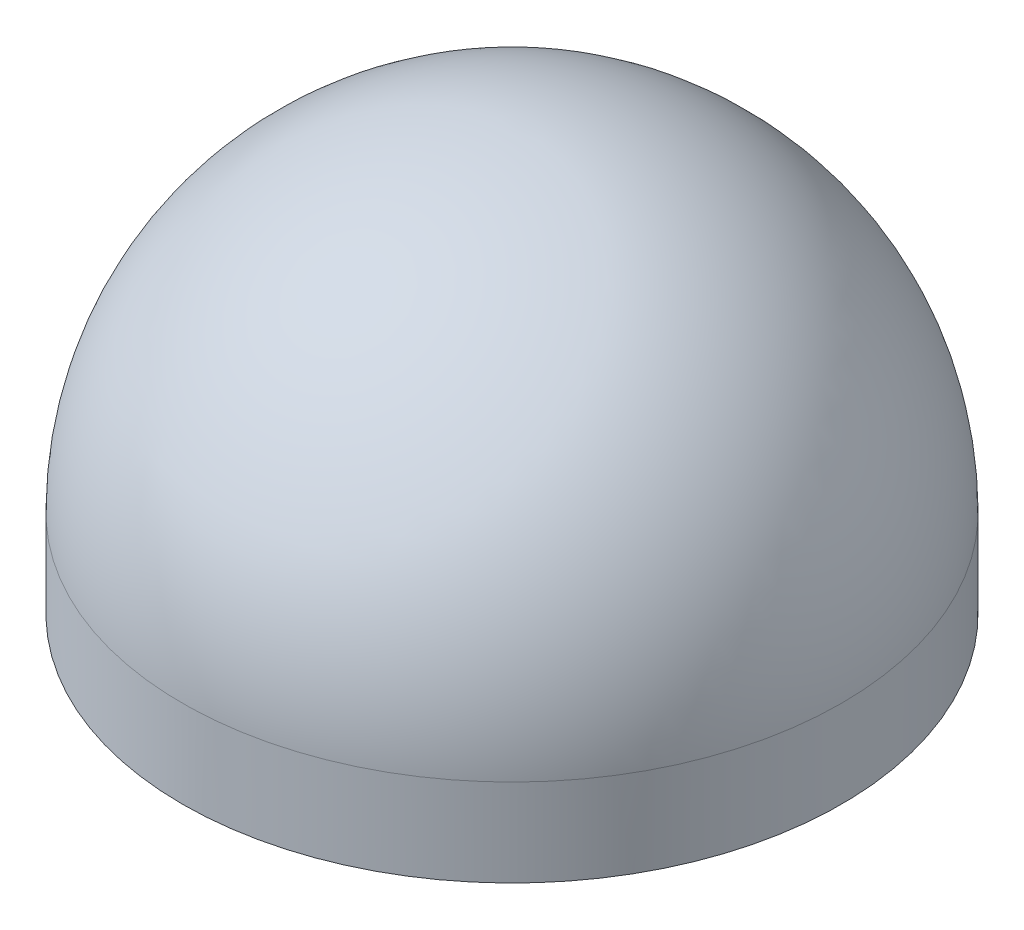
ISO-10303-21;
HEADER;
FILE_DESCRIPTION(('STEP AP214'),'2;1');
FILE_NAME('part.step','',(''),(''),'','','');
FILE_SCHEMA(('AUTOMOTIVE_DESIGN { 1 0 10303 214 1 1 1 1 }'));
ENDSEC;
DATA;
#1=APPLICATION_CONTEXT('core data for automotive mechanical design processes');
#2=APPLICATION_PROTOCOL_DEFINITION('international standard','automotive_design',2000,#1);
#3=PRODUCT_CONTEXT('',#1,'mechanical');
#4=PRODUCT('Part','Part','',(#3));
#5=PRODUCT_RELATED_PRODUCT_CATEGORY('part','',(#4));
#6=PRODUCT_DEFINITION_FORMATION('','',#4);
#7=PRODUCT_DEFINITION_CONTEXT('part definition',#1,'design');
#8=PRODUCT_DEFINITION('design','',#6,#7);
#9=PRODUCT_DEFINITION_SHAPE('','',#8);
#10=(LENGTH_UNIT() NAMED_UNIT(*) SI_UNIT(.MILLI.,.METRE.));
#11=(NAMED_UNIT(*) PLANE_ANGLE_UNIT() SI_UNIT($,.RADIAN.));
#12=(NAMED_UNIT(*) SI_UNIT($,.STERADIAN.) SOLID_ANGLE_UNIT());
#13=UNCERTAINTY_MEASURE_WITH_UNIT(LENGTH_MEASURE(1.E-05),#10,'distance_accuracy_value','');
#14=(GEOMETRIC_REPRESENTATION_CONTEXT(3) GLOBAL_UNCERTAINTY_ASSIGNED_CONTEXT((#13)) GLOBAL_UNIT_ASSIGNED_CONTEXT((#10,
#11,#12)) REPRESENTATION_CONTEXT('',''));
#15=CARTESIAN_POINT('',(0.,0.,0.));
#16=DIRECTION('',(0.,0.,1.));
#17=DIRECTION('',(1.,0.,0.));
#18=AXIS2_PLACEMENT_3D('',#15,#16,#17);
#19=CARTESIAN_POINT('',(0.,0.,0.));
#20=DIRECTION('',(0.,-1.,0.));
#21=DIRECTION('',(0.,0.,-1.));
#22=AXIS2_PLACEMENT_3D('',#19,#20,#21);
#23=CYLINDRICAL_SURFACE('',#22,22.225);
#24=CARTESIAN_POINT('',(0.,0.,0.));
#25=DIRECTION('',(0.,-1.,0.));
#26=DIRECTION('',(0.,0.,-1.));
#27=AXIS2_PLACEMENT_3D('',#24,#25,#26);
#28=CIRCLE('',#27,22.225);
#29=CARTESIAN_POINT('',(0.,0.,-22.225));
#30=VERTEX_POINT('',#29);
#31=EDGE_CURVE('E62',#30,#30,#28,.T.);
#32=ORIENTED_EDGE('',*,*,#31,.F.);
#33=EDGE_LOOP('',(#32));
#34=FACE_BOUND('',#33,.T.);
#35=CARTESIAN_POINT('',(0.,5.896631452317,0.));
#36=DIRECTION('',(0.,-1.,0.));
#37=DIRECTION('',(0.,0.,-1.));
#38=AXIS2_PLACEMENT_3D('',#35,#36,#37);
#39=CIRCLE('',#38,22.225);
#40=CARTESIAN_POINT('',(0.,5.896631452317,-22.225));
#41=VERTEX_POINT('',#40);
#42=EDGE_CURVE('E10',#41,#41,#39,.T.);
#43=ORIENTED_EDGE('',*,*,#42,.T.);
#44=EDGE_LOOP('',(#43));
#45=FACE_BOUND('',#44,.T.);
#46=ADVANCED_FACE('F31',(#34,#45),#23,.T.);
#47=CARTESIAN_POINT('',(0.,5.896631452317,0.));
#48=DIRECTION('',(0.,-1.,0.));
#49=DIRECTION('',(1.,0.,0.));
#50=AXIS2_PLACEMENT_3D('',#47,#48,#49);
#51=SPHERICAL_SURFACE('',#50,22.225);
#52=ORIENTED_EDGE('',*,*,#42,.F.);
#53=EDGE_LOOP('',(#52));
#54=FACE_BOUND('',#53,.T.);
#55=ADVANCED_FACE('F69',(#54),#51,.T.);
#56=CARTESIAN_POINT('',(6.35,24.946631452317,0.));
#57=DIRECTION('',(0.,1.,0.));
#58=DIRECTION('',(0.,0.,1.));
#59=AXIS2_PLACEMENT_3D('',#56,#57,#58);
#60=PLANE('',#59);
#61=CARTESIAN_POINT('',(0.,24.946631452317,0.));
#62=DIRECTION('',(0.,-1.,0.));
#63=DIRECTION('',(0.,0.,-1.));
#64=AXIS2_PLACEMENT_3D('',#61,#62,#63);
#65=CIRCLE('',#64,6.35);
#66=CARTESIAN_POINT('',(0.,24.946631452317,-6.35));
#67=VERTEX_POINT('',#66);
#68=EDGE_CURVE('E37',#67,#67,#65,.T.);
#69=ORIENTED_EDGE('',*,*,#68,.T.);
#70=EDGE_LOOP('',(#69));
#71=FACE_BOUND('',#70,.T.);
#72=ADVANCED_FACE('F73',(#71),#60,.F.);
#73=CARTESIAN_POINT('',(0.,3.76205517950723,0.));
#74=DIRECTION('',(0.,-1.,0.));
#75=DIRECTION('',(0.,0.,-1.));
#76=AXIS2_PLACEMENT_3D('',#73,#74,#75);
#77=CONICAL_SURFACE('',#76,21.1836,0.610865238198017);
#78=ORIENTED_EDGE('',*,*,#68,.F.);
#79=EDGE_LOOP('',(#78));
#80=FACE_BOUND('',#79,.T.);
#81=CARTESIAN_POINT('',(0.,3.76205517950723,0.));
#82=DIRECTION('',(0.,-1.,0.));
#83=DIRECTION('',(0.,0.,-1.));
#84=AXIS2_PLACEMENT_3D('',#81,#82,#83);
#85=CIRCLE('',#84,21.1836);
#86=CARTESIAN_POINT('',(0.,3.76205517950723,-21.1836));
#87=VERTEX_POINT('',#86);
#88=EDGE_CURVE('E41',#87,#87,#85,.T.);
#89=ORIENTED_EDGE('',*,*,#88,.T.);
#90=EDGE_LOOP('',(#89));
#91=FACE_BOUND('',#90,.T.);
#92=ADVANCED_FACE('F78',(#80,#91),#77,.F.);
#93=CARTESIAN_POINT('',(0.,0.,0.));
#94=DIRECTION('',(0.,-1.,0.));
#95=DIRECTION('',(0.,0.,-1.));
#96=AXIS2_PLACEMENT_3D('',#93,#94,#95);
#97=CYLINDRICAL_SURFACE('',#96,21.1836);
#98=ORIENTED_EDGE('',*,*,#88,.F.);
#99=EDGE_LOOP('',(#98));
#100=FACE_BOUND('',#99,.T.);
#101=CARTESIAN_POINT('',(0.,2.1082,0.));
#102=DIRECTION('',(0.,-1.,0.));
#103=DIRECTION('',(0.,0.,-1.));
#104=AXIS2_PLACEMENT_3D('',#101,#102,#103);
#105=CIRCLE('',#104,21.1836);
#106=CARTESIAN_POINT('',(0.,2.1082,-21.1836));
#107=VERTEX_POINT('',#106);
#108=EDGE_CURVE('E45',#107,#107,#105,.T.);
#109=ORIENTED_EDGE('',*,*,#108,.T.);
#110=EDGE_LOOP('',(#109));
#111=FACE_BOUND('',#110,.T.);
#112=ADVANCED_FACE('F83',(#100,#111),#97,.F.);
#113=CARTESIAN_POINT('',(6.35,2.1082,0.));
#114=DIRECTION('',(0.,-1.,0.));
#115=DIRECTION('',(0.,0.,-1.));
#116=AXIS2_PLACEMENT_3D('',#113,#114,#115);
#117=PLANE('',#116);
#118=ORIENTED_EDGE('',*,*,#108,.F.);
#119=EDGE_LOOP('',(#118));
#120=FACE_BOUND('',#119,.T.);
#121=CARTESIAN_POINT('',(0.,2.1082,0.));
#122=DIRECTION('',(0.,-1.,0.));
#123=DIRECTION('',(0.,0.,-1.));
#124=AXIS2_PLACEMENT_3D('',#121,#122,#123);
#125=CIRCLE('',#124,6.35);
#126=CARTESIAN_POINT('',(0.,2.1082,-6.35));
#127=VERTEX_POINT('',#126);
#128=EDGE_CURVE('E50',#127,#127,#125,.T.);
#129=ORIENTED_EDGE('',*,*,#128,.T.);
#130=EDGE_LOOP('',(#129));
#131=FACE_BOUND('',#130,.T.);
#132=ADVANCED_FACE('F87',(#120,#131),#117,.F.);
#133=CARTESIAN_POINT('',(0.,0.,0.));
#134=DIRECTION('',(0.,-1.,0.));
#135=DIRECTION('',(0.,0.,-1.));
#136=AXIS2_PLACEMENT_3D('',#133,#134,#135);
#137=CYLINDRICAL_SURFACE('',#136,6.35);
#138=ORIENTED_EDGE('',*,*,#128,.F.);
#139=EDGE_LOOP('',(#138));
#140=FACE_BOUND('',#139,.T.);
#141=CARTESIAN_POINT('',(0.,6.35,0.));
#142=DIRECTION('',(0.,-1.,0.));
#143=DIRECTION('',(0.,0.,-1.));
#144=AXIS2_PLACEMENT_3D('',#141,#142,#143);
#145=CIRCLE('',#144,6.35);
#146=CARTESIAN_POINT('',(0.,6.35,-6.35));
#147=VERTEX_POINT('',#146);
#148=EDGE_CURVE('E53',#147,#147,#145,.T.);
#149=ORIENTED_EDGE('',*,*,#148,.T.);
#150=EDGE_LOOP('',(#149));
#151=FACE_BOUND('',#150,.T.);
#152=ADVANCED_FACE('F91',(#140,#151),#137,.T.);
#153=CARTESIAN_POINT('',(1.5875,6.35,0.));
#154=DIRECTION('',(0.,-1.,0.));
#155=DIRECTION('',(0.,0.,-1.));
#156=AXIS2_PLACEMENT_3D('',#153,#154,#155);
#157=PLANE('',#156);
#158=ORIENTED_EDGE('',*,*,#148,.F.);
#159=EDGE_LOOP('',(#158));
#160=FACE_BOUND('',#159,.T.);
#161=CARTESIAN_POINT('',(0.,6.35,0.));
#162=DIRECTION('',(0.,-1.,0.));
#163=DIRECTION('',(0.,0.,-1.));
#164=AXIS2_PLACEMENT_3D('',#161,#162,#163);
#165=CIRCLE('',#164,1.5875);
#166=CARTESIAN_POINT('',(0.,6.35,-1.5875));
#167=VERTEX_POINT('',#166);
#168=EDGE_CURVE('E56',#167,#167,#165,.T.);
#169=ORIENTED_EDGE('',*,*,#168,.T.);
#170=EDGE_LOOP('',(#169));
#171=FACE_BOUND('',#170,.T.);
#172=ADVANCED_FACE('F95',(#160,#171),#157,.F.);
#173=CARTESIAN_POINT('',(0.,0.,0.));
#174=DIRECTION('',(0.,-1.,0.));
#175=DIRECTION('',(0.,0.,-1.));
#176=AXIS2_PLACEMENT_3D('',#173,#174,#175);
#177=CYLINDRICAL_SURFACE('',#176,1.5875);
#178=ORIENTED_EDGE('',*,*,#168,.F.);
#179=EDGE_LOOP('',(#178));
#180=FACE_BOUND('',#179,.T.);
#181=CARTESIAN_POINT('',(0.,0.,0.));
#182=DIRECTION('',(0.,-1.,0.));
#183=DIRECTION('',(0.,0.,-1.));
#184=AXIS2_PLACEMENT_3D('',#181,#182,#183);
#185=CIRCLE('',#184,1.5875);
#186=CARTESIAN_POINT('',(0.,0.,-1.5875));
#187=VERTEX_POINT('',#186);
#188=EDGE_CURVE('E59',#187,#187,#185,.T.);
#189=ORIENTED_EDGE('',*,*,#188,.T.);
#190=EDGE_LOOP('',(#189));
#191=FACE_BOUND('',#190,.T.);
#192=ADVANCED_FACE('F99',(#180,#191),#177,.F.);
#193=CARTESIAN_POINT('',(1.5875,0.,0.));
#194=DIRECTION('',(0.,1.,0.));
#195=DIRECTION('',(0.,0.,1.));
#196=AXIS2_PLACEMENT_3D('',#193,#194,#195);
#197=PLANE('',#196);
#198=ORIENTED_EDGE('',*,*,#188,.F.);
#199=EDGE_LOOP('',(#198));
#200=FACE_BOUND('',#199,.T.);
#201=ORIENTED_EDGE('',*,*,#31,.T.);
#202=EDGE_LOOP('',(#201));
#203=FACE_BOUND('',#202,.T.);
#204=ADVANCED_FACE('F66',(#200,#203),#197,.F.);
#205=CLOSED_SHELL('',(#46,#55,#72,#92,#112,#132,#152,#172,#192,#204));
#206=MANIFOLD_SOLID_BREP('B2',#205);
#207=ADVANCED_BREP_SHAPE_REPRESENTATION('',(#18,#206),#14);
#208=SHAPE_DEFINITION_REPRESENTATION(#9,#207);
ENDSEC;
END-ISO-10303-21;
